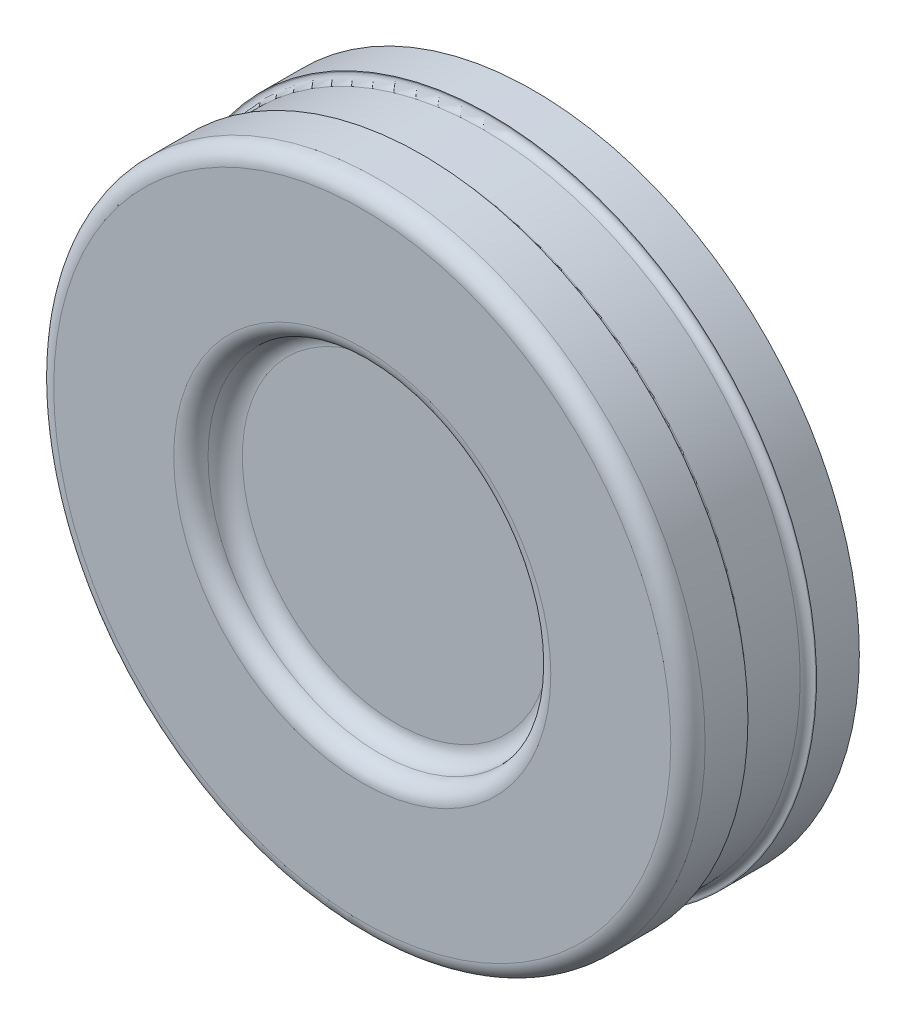
ISO-10303-21;
HEADER;
FILE_DESCRIPTION(('STEP AP214'),'2;1');
FILE_NAME('part.step','',(''),(''),'','','');
FILE_SCHEMA(('AUTOMOTIVE_DESIGN { 1 0 10303 214 1 1 1 1 }'));
ENDSEC;
DATA;
#1=APPLICATION_CONTEXT('core data for automotive mechanical design processes');
#2=APPLICATION_PROTOCOL_DEFINITION('international standard','automotive_design',2000,#1);
#3=PRODUCT_CONTEXT('',#1,'mechanical');
#4=PRODUCT('Part','Part','',(#3));
#5=PRODUCT_RELATED_PRODUCT_CATEGORY('part','',(#4));
#6=PRODUCT_DEFINITION_FORMATION('','',#4);
#7=PRODUCT_DEFINITION_CONTEXT('part definition',#1,'design');
#8=PRODUCT_DEFINITION('design','',#6,#7);
#9=PRODUCT_DEFINITION_SHAPE('','',#8);
#10=(LENGTH_UNIT() NAMED_UNIT(*) SI_UNIT(.MILLI.,.METRE.));
#11=(NAMED_UNIT(*) PLANE_ANGLE_UNIT() SI_UNIT($,.RADIAN.));
#12=(NAMED_UNIT(*) SI_UNIT($,.STERADIAN.) SOLID_ANGLE_UNIT());
#13=UNCERTAINTY_MEASURE_WITH_UNIT(LENGTH_MEASURE(1.E-05),#10,'distance_accuracy_value','');
#14=(GEOMETRIC_REPRESENTATION_CONTEXT(3) GLOBAL_UNCERTAINTY_ASSIGNED_CONTEXT((#13)) GLOBAL_UNIT_ASSIGNED_CONTEXT((#10,
#11,#12)) REPRESENTATION_CONTEXT('',''));
#15=CARTESIAN_POINT('',(0.,0.,0.));
#16=DIRECTION('',(0.,0.,1.));
#17=DIRECTION('',(1.,0.,0.));
#18=AXIS2_PLACEMENT_3D('',#15,#16,#17);
#19=CARTESIAN_POINT('',(0.,0.,10.));
#20=DIRECTION('',(0.,0.,-1.));
#21=DIRECTION('',(-1.,0.,0.));
#22=AXIS2_PLACEMENT_3D('',#19,#20,#21);
#23=CYLINDRICAL_SURFACE('',#22,19.);
#24=CARTESIAN_POINT('',(0.,0.,6.49999999999999));
#25=DIRECTION('',(0.,0.,1.));
#26=DIRECTION('',(1.,0.,0.));
#27=AXIS2_PLACEMENT_3D('',#24,#25,#26);
#28=CIRCLE('',#27,19.);
#29=CARTESIAN_POINT('',(19.,0.,6.49999999999999));
#30=VERTEX_POINT('',#29);
#31=EDGE_CURVE('E58',#30,#30,#28,.T.);
#32=ORIENTED_EDGE('',*,*,#31,.T.);
#33=EDGE_LOOP('',(#32));
#34=FACE_BOUND('',#33,.T.);
#35=CARTESIAN_POINT('',(0.,0.,9.));
#36=DIRECTION('',(0.,0.,1.));
#37=DIRECTION('',(1.,0.,0.));
#38=AXIS2_PLACEMENT_3D('',#35,#36,#37);
#39=CIRCLE('',#38,19.);
#40=CARTESIAN_POINT('',(19.,0.,9.));
#41=VERTEX_POINT('',#40);
#42=EDGE_CURVE('E53',#41,#41,#39,.F.);
#43=ORIENTED_EDGE('',*,*,#42,.T.);
#44=EDGE_LOOP('',(#43));
#45=FACE_BOUND('',#44,.T.);
#46=ADVANCED_FACE('F33',(#34,#45),#23,.T.);
#47=CARTESIAN_POINT('',(0.,0.,10.));
#48=DIRECTION('',(0.,0.,1.));
#49=DIRECTION('',(1.,0.,0.));
#50=AXIS2_PLACEMENT_3D('',#47,#48,#49);
#51=PLANE('',#50);
#52=CARTESIAN_POINT('',(0.,0.,10.));
#53=DIRECTION('',(0.,0.,1.));
#54=DIRECTION('',(1.,0.,0.));
#55=AXIS2_PLACEMENT_3D('',#52,#53,#54);
#56=CIRCLE('',#55,11.);
#57=CARTESIAN_POINT('',(11.,0.,10.));
#58=VERTEX_POINT('',#57);
#59=EDGE_CURVE('E66',#58,#58,#56,.F.);
#60=ORIENTED_EDGE('',*,*,#59,.T.);
#61=EDGE_LOOP('',(#60));
#62=FACE_BOUND('',#61,.T.);
#63=CARTESIAN_POINT('',(0.,0.,10.));
#64=DIRECTION('',(0.,0.,1.));
#65=DIRECTION('',(1.,0.,0.));
#66=AXIS2_PLACEMENT_3D('',#63,#64,#65);
#67=CIRCLE('',#66,18.);
#68=CARTESIAN_POINT('',(18.,0.,10.));
#69=VERTEX_POINT('',#68);
#70=EDGE_CURVE('E69',#69,#69,#67,.T.);
#71=ORIENTED_EDGE('',*,*,#70,.T.);
#72=EDGE_LOOP('',(#71));
#73=FACE_BOUND('',#72,.T.);
#74=ADVANCED_FACE('F98',(#62,#73),#51,.T.);
#75=CARTESIAN_POINT('',(0.,0.,8.));
#76=DIRECTION('',(0.,0.,1.));
#77=DIRECTION('',(1.,0.,0.));
#78=AXIS2_PLACEMENT_3D('',#75,#76,#77);
#79=PLANE('',#78);
#80=CARTESIAN_POINT('',(0.,0.,8.));
#81=DIRECTION('',(0.,0.,1.));
#82=DIRECTION('',(1.,0.,0.));
#83=AXIS2_PLACEMENT_3D('',#80,#81,#82);
#84=CIRCLE('',#83,9.);
#85=CARTESIAN_POINT('',(9.,0.,8.));
#86=VERTEX_POINT('',#85);
#87=EDGE_CURVE('E72',#86,#86,#84,.T.);
#88=ORIENTED_EDGE('',*,*,#87,.T.);
#89=EDGE_LOOP('',(#88));
#90=FACE_BOUND('',#89,.T.);
#91=ADVANCED_FACE('F103',(#90),#79,.T.);
#92=CARTESIAN_POINT('',(0.,0.,9.));
#93=DIRECTION('',(0.,0.,1.));
#94=DIRECTION('',(1.,0.,0.));
#95=AXIS2_PLACEMENT_3D('',#92,#93,#94);
#96=TOROIDAL_SURFACE('',#95,11.,1.);
#97=ORIENTED_EDGE('',*,*,#59,.F.);
#98=EDGE_LOOP('',(#97));
#99=FACE_BOUND('',#98,.T.);
#100=CARTESIAN_POINT('',(0.,0.,9.));
#101=DIRECTION('',(0.,0.,1.));
#102=DIRECTION('',(1.,0.,0.));
#103=AXIS2_PLACEMENT_3D('',#100,#101,#102);
#104=CIRCLE('',#103,10.);
#105=CARTESIAN_POINT('',(10.,0.,9.));
#106=VERTEX_POINT('',#105);
#107=EDGE_CURVE('E57',#106,#106,#104,.T.);
#108=ORIENTED_EDGE('',*,*,#107,.F.);
#109=EDGE_LOOP('',(#108));
#110=FACE_BOUND('',#109,.T.);
#111=ADVANCED_FACE('F111',(#99,#110),#96,.T.);
#112=CARTESIAN_POINT('',(0.,0.,9.));
#113=DIRECTION('',(0.,0.,1.));
#114=DIRECTION('',(1.,0.,0.));
#115=AXIS2_PLACEMENT_3D('',#112,#113,#114);
#116=TOROIDAL_SURFACE('',#115,9.,1.);
#117=ORIENTED_EDGE('',*,*,#107,.T.);
#118=EDGE_LOOP('',(#117));
#119=FACE_BOUND('',#118,.T.);
#120=ORIENTED_EDGE('',*,*,#87,.F.);
#121=EDGE_LOOP('',(#120));
#122=FACE_BOUND('',#121,.T.);
#123=ADVANCED_FACE('F107',(#119,#122),#116,.F.);
#124=CARTESIAN_POINT('',(0.,0.,9.));
#125=DIRECTION('',(0.,0.,1.));
#126=DIRECTION('',(1.,0.,0.));
#127=AXIS2_PLACEMENT_3D('',#124,#125,#126);
#128=TOROIDAL_SURFACE('',#127,18.,1.);
#129=ORIENTED_EDGE('',*,*,#42,.F.);
#130=EDGE_LOOP('',(#129));
#131=FACE_BOUND('',#130,.T.);
#132=ORIENTED_EDGE('',*,*,#70,.F.);
#133=EDGE_LOOP('',(#132));
#134=FACE_BOUND('',#133,.T.);
#135=ADVANCED_FACE('F110',(#131,#134),#128,.T.);
#136=CARTESIAN_POINT('',(-19.5,0.,2.49999999999999));
#137=DIRECTION('',(0.,0.,-1.));
#138=DIRECTION('',(-1.,0.,0.));
#139=AXIS2_PLACEMENT_3D('',#136,#137,#138);
#140=PLANE('',#139);
#141=CARTESIAN_POINT('',(0.,0.,2.49999999999999));
#142=DIRECTION('',(0.,0.,-1.));
#143=DIRECTION('',(-1.,0.,0.));
#144=AXIS2_PLACEMENT_3D('',#141,#142,#143);
#145=CIRCLE('',#144,18.95);
#146=CARTESIAN_POINT('',(-18.95,0.,2.49999999999999));
#147=VERTEX_POINT('',#146);
#148=EDGE_CURVE('E10',#147,#147,#145,.T.);
#149=ORIENTED_EDGE('',*,*,#148,.T.);
#150=EDGE_LOOP('',(#149));
#151=FACE_BOUND('',#150,.T.);
#152=CARTESIAN_POINT('',(0.,0.,2.49999999999999));
#153=DIRECTION('',(0.,0.,-1.));
#154=DIRECTION('',(-1.,0.,0.));
#155=AXIS2_PLACEMENT_3D('',#152,#153,#154);
#156=CIRCLE('',#155,19.);
#157=CARTESIAN_POINT('',(-19.,0.,2.49999999999999));
#158=VERTEX_POINT('',#157);
#159=EDGE_CURVE('E54',#158,#158,#156,.T.);
#160=ORIENTED_EDGE('',*,*,#159,.F.);
#161=EDGE_LOOP('',(#160));
#162=FACE_BOUND('',#161,.T.);
#163=ADVANCED_FACE('F117',(#151,#162),#140,.F.);
#164=CARTESIAN_POINT('',(-19.5,0.,6.49999999999999));
#165=DIRECTION('',(0.,0.,1.));
#166=DIRECTION('',(1.,0.,0.));
#167=AXIS2_PLACEMENT_3D('',#164,#165,#166);
#168=PLANE('',#167);
#169=CARTESIAN_POINT('',(0.,0.,6.49999999999999));
#170=DIRECTION('',(0.,0.,1.));
#171=DIRECTION('',(1.,0.,0.));
#172=AXIS2_PLACEMENT_3D('',#169,#170,#171);
#173=CIRCLE('',#172,18.95);
#174=CARTESIAN_POINT('',(18.95,0.,6.49999999999999));
#175=VERTEX_POINT('',#174);
#176=EDGE_CURVE('E40',#175,#175,#173,.T.);
#177=ORIENTED_EDGE('',*,*,#176,.T.);
#178=EDGE_LOOP('',(#177));
#179=FACE_BOUND('',#178,.T.);
#180=ORIENTED_EDGE('',*,*,#31,.F.);
#181=EDGE_LOOP('',(#180));
#182=FACE_BOUND('',#181,.T.);
#183=ADVANCED_FACE('F93',(#179,#182),#168,.F.);
#184=CARTESIAN_POINT('',(0.,0.,0.));
#185=DIRECTION('',(0.,0.,-1.));
#186=DIRECTION('',(-1.,0.,0.));
#187=AXIS2_PLACEMENT_3D('',#184,#185,#186);
#188=CYLINDRICAL_SURFACE('',#187,18.5);
#189=CARTESIAN_POINT('',(0.,0.,6.04999999999999));
#190=DIRECTION('',(0.,0.,1.));
#191=DIRECTION('',(1.,0.,0.));
#192=AXIS2_PLACEMENT_3D('',#189,#190,#191);
#193=CIRCLE('',#192,18.5);
#194=CARTESIAN_POINT('',(18.5,0.,6.04999999999999));
#195=VERTEX_POINT('',#194);
#196=EDGE_CURVE('E44',#195,#195,#193,.F.);
#197=ORIENTED_EDGE('',*,*,#196,.T.);
#198=EDGE_LOOP('',(#197));
#199=FACE_BOUND('',#198,.T.);
#200=CARTESIAN_POINT('',(0.,0.,2.94999999999999));
#201=DIRECTION('',(0.,0.,-1.));
#202=DIRECTION('',(-1.,0.,0.));
#203=AXIS2_PLACEMENT_3D('',#200,#201,#202);
#204=CIRCLE('',#203,18.5);
#205=CARTESIAN_POINT('',(-18.5,0.,2.94999999999999));
#206=VERTEX_POINT('',#205);
#207=EDGE_CURVE('E48',#206,#206,#204,.F.);
#208=ORIENTED_EDGE('',*,*,#207,.T.);
#209=EDGE_LOOP('',(#208));
#210=FACE_BOUND('',#209,.T.);
#211=ADVANCED_FACE('F82',(#199,#210),#188,.T.);
#212=CARTESIAN_POINT('',(0.,0.,0.));
#213=DIRECTION('',(0.,0.,1.));
#214=DIRECTION('',(1.,0.,0.));
#215=AXIS2_PLACEMENT_3D('',#212,#213,#214);
#216=PLANE('',#215);
#217=CARTESIAN_POINT('',(0.,0.,0.));
#218=DIRECTION('',(0.,0.,1.));
#219=DIRECTION('',(1.,0.,0.));
#220=AXIS2_PLACEMENT_3D('',#217,#218,#219);
#221=CIRCLE('',#220,19.);
#222=CARTESIAN_POINT('',(19.,0.,0.));
#223=VERTEX_POINT('',#222);
#224=EDGE_CURVE('E63',#223,#223,#221,.T.);
#225=ORIENTED_EDGE('',*,*,#224,.F.);
#226=EDGE_LOOP('',(#225));
#227=FACE_BOUND('',#226,.T.);
#228=ADVANCED_FACE('F80',(#227),#216,.F.);
#229=ORIENTED_EDGE('',*,*,#159,.T.);
#230=EDGE_LOOP('',(#229));
#231=FACE_BOUND('',#230,.T.);
#232=ORIENTED_EDGE('',*,*,#224,.T.);
#233=EDGE_LOOP('',(#232));
#234=FACE_BOUND('',#233,.T.);
#235=ADVANCED_FACE('F78',(#231,#234),#23,.T.);
#236=CARTESIAN_POINT('',(0.,0.,6.04999999999999));
#237=DIRECTION('',(0.,0.,1.));
#238=DIRECTION('',(1.,0.,0.));
#239=AXIS2_PLACEMENT_3D('',#236,#237,#238);
#240=TOROIDAL_SURFACE('',#239,18.95,0.45);
#241=ORIENTED_EDGE('',*,*,#176,.F.);
#242=EDGE_LOOP('',(#241));
#243=FACE_BOUND('',#242,.T.);
#244=ORIENTED_EDGE('',*,*,#196,.F.);
#245=EDGE_LOOP('',(#244));
#246=FACE_BOUND('',#245,.T.);
#247=ADVANCED_FACE('F89',(#243,#246),#240,.F.);
#248=CARTESIAN_POINT('',(0.,0.,2.94999999999999));
#249=DIRECTION('',(0.,0.,-1.));
#250=DIRECTION('',(-1.,0.,0.));
#251=AXIS2_PLACEMENT_3D('',#248,#249,#250);
#252=TOROIDAL_SURFACE('',#251,18.95,0.45);
#253=ORIENTED_EDGE('',*,*,#207,.F.);
#254=EDGE_LOOP('',(#253));
#255=FACE_BOUND('',#254,.T.);
#256=ORIENTED_EDGE('',*,*,#148,.F.);
#257=EDGE_LOOP('',(#256));
#258=FACE_BOUND('',#257,.T.);
#259=ADVANCED_FACE('F35',(#255,#258),#252,.F.);
#260=CLOSED_SHELL('',(#46,#74,#91,#111,#123,#135,#163,#183,#211,#228,#235,#247,#259));
#261=MANIFOLD_SOLID_BREP('B2',#260);
#262=ADVANCED_BREP_SHAPE_REPRESENTATION('',(#18,#261),#14);
#263=SHAPE_DEFINITION_REPRESENTATION(#9,#262);
ENDSEC;
END-ISO-10303-21;
